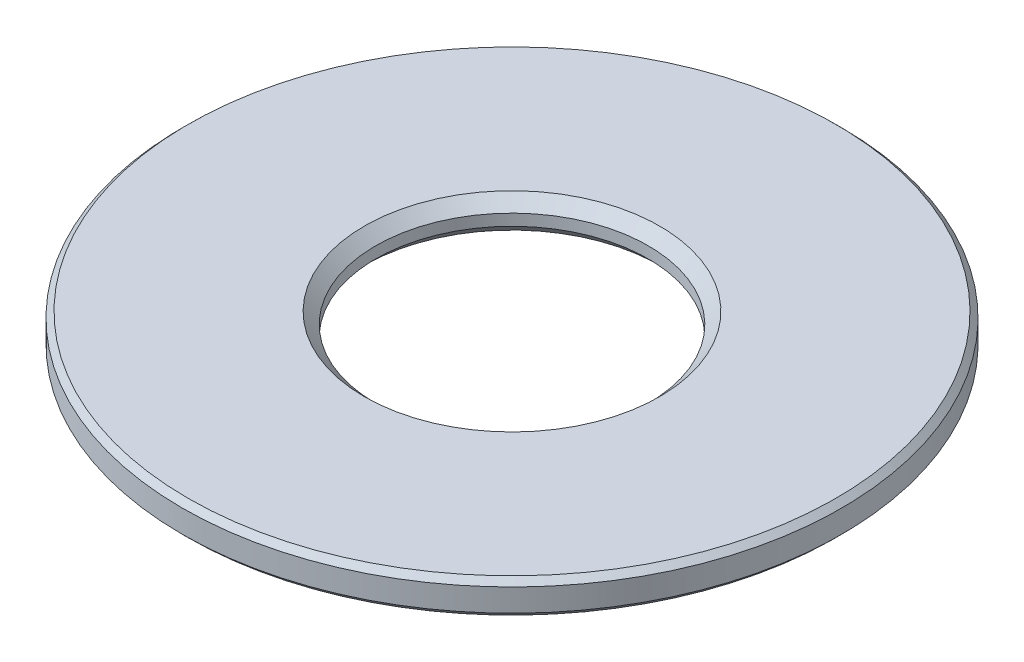
ISO-10303-21;
HEADER;
FILE_DESCRIPTION(('STEP AP214'),'2;1');
FILE_NAME('part.step','',(''),(''),'','','');
FILE_SCHEMA(('AUTOMOTIVE_DESIGN { 1 0 10303 214 1 1 1 1 }'));
ENDSEC;
DATA;
#1=APPLICATION_CONTEXT('core data for automotive mechanical design processes');
#2=APPLICATION_PROTOCOL_DEFINITION('international standard','automotive_design',2000,#1);
#3=PRODUCT_CONTEXT('',#1,'mechanical');
#4=PRODUCT('Part','Part','',(#3));
#5=PRODUCT_RELATED_PRODUCT_CATEGORY('part','',(#4));
#6=PRODUCT_DEFINITION_FORMATION('','',#4);
#7=PRODUCT_DEFINITION_CONTEXT('part definition',#1,'design');
#8=PRODUCT_DEFINITION('design','',#6,#7);
#9=PRODUCT_DEFINITION_SHAPE('','',#8);
#10=(LENGTH_UNIT() NAMED_UNIT(*) SI_UNIT(.MILLI.,.METRE.));
#11=(NAMED_UNIT(*) PLANE_ANGLE_UNIT() SI_UNIT($,.RADIAN.));
#12=(NAMED_UNIT(*) SI_UNIT($,.STERADIAN.) SOLID_ANGLE_UNIT());
#13=UNCERTAINTY_MEASURE_WITH_UNIT(LENGTH_MEASURE(1.E-05),#10,'distance_accuracy_value','');
#14=(GEOMETRIC_REPRESENTATION_CONTEXT(3) GLOBAL_UNCERTAINTY_ASSIGNED_CONTEXT((#13)) GLOBAL_UNIT_ASSIGNED_CONTEXT((#10,
#11,#12)) REPRESENTATION_CONTEXT('',''));
#15=CARTESIAN_POINT('',(0.,0.,0.));
#16=DIRECTION('',(0.,0.,1.));
#17=DIRECTION('',(1.,0.,0.));
#18=AXIS2_PLACEMENT_3D('',#15,#16,#17);
#19=CARTESIAN_POINT('',(0.,3.,0.));
#20=DIRECTION('',(0.,-1.,0.));
#21=DIRECTION('',(0.,0.,-1.));
#22=AXIS2_PLACEMENT_3D('',#19,#20,#21);
#23=CYLINDRICAL_SURFACE('',#22,29.);
#24=CARTESIAN_POINT('',(0.,0.5,0.));
#25=DIRECTION('',(0.,1.,0.));
#26=DIRECTION('',(0.,0.,1.));
#27=AXIS2_PLACEMENT_3D('',#24,#25,#26);
#28=CIRCLE('',#27,29.);
#29=CARTESIAN_POINT('',(0.,0.5,29.));
#30=VERTEX_POINT('',#29);
#31=EDGE_CURVE('E55',#30,#30,#28,.T.);
#32=ORIENTED_EDGE('',*,*,#31,.T.);
#33=EDGE_LOOP('',(#32));
#34=FACE_BOUND('',#33,.T.);
#35=CARTESIAN_POINT('',(0.,2.5,0.));
#36=DIRECTION('',(0.,1.,0.));
#37=DIRECTION('',(0.,0.,1.));
#38=AXIS2_PLACEMENT_3D('',#35,#36,#37);
#39=CIRCLE('',#38,29.);
#40=CARTESIAN_POINT('',(0.,2.5,29.));
#41=VERTEX_POINT('',#40);
#42=EDGE_CURVE('E58',#41,#41,#39,.F.);
#43=ORIENTED_EDGE('',*,*,#42,.T.);
#44=EDGE_LOOP('',(#43));
#45=FACE_BOUND('',#44,.T.);
#46=ADVANCED_FACE('F30',(#34,#45),#23,.T.);
#47=CARTESIAN_POINT('',(0.,3.,0.));
#48=DIRECTION('',(0.,1.,0.));
#49=DIRECTION('',(0.,0.,1.));
#50=AXIS2_PLACEMENT_3D('',#47,#48,#49);
#51=PLANE('',#50);
#52=CARTESIAN_POINT('',(0.,3.,0.));
#53=DIRECTION('',(0.,1.,0.));
#54=DIRECTION('',(0.,0.,1.));
#55=AXIS2_PLACEMENT_3D('',#52,#53,#54);
#56=CIRCLE('',#55,13.);
#57=CARTESIAN_POINT('',(0.,3.,13.));
#58=VERTEX_POINT('',#57);
#59=EDGE_CURVE('E10',#58,#58,#56,.F.);
#60=ORIENTED_EDGE('',*,*,#59,.T.);
#61=EDGE_LOOP('',(#60));
#62=FACE_BOUND('',#61,.T.);
#63=CARTESIAN_POINT('',(0.,3.,0.));
#64=DIRECTION('',(0.,1.,0.));
#65=DIRECTION('',(0.,0.,1.));
#66=AXIS2_PLACEMENT_3D('',#63,#64,#65);
#67=CIRCLE('',#66,28.5);
#68=CARTESIAN_POINT('',(0.,3.,28.5));
#69=VERTEX_POINT('',#68);
#70=EDGE_CURVE('E49',#69,#69,#67,.T.);
#71=ORIENTED_EDGE('',*,*,#70,.T.);
#72=EDGE_LOOP('',(#71));
#73=FACE_BOUND('',#72,.T.);
#74=ADVANCED_FACE('F71',(#62,#73),#51,.T.);
#75=CARTESIAN_POINT('',(0.,0.,0.));
#76=DIRECTION('',(0.,1.,0.));
#77=DIRECTION('',(0.,0.,1.));
#78=AXIS2_PLACEMENT_3D('',#75,#76,#77);
#79=PLANE('',#78);
#80=CARTESIAN_POINT('',(0.,0.,0.));
#81=DIRECTION('',(0.,1.,0.));
#82=DIRECTION('',(0.,0.,1.));
#83=AXIS2_PLACEMENT_3D('',#80,#81,#82);
#84=CIRCLE('',#83,13.);
#85=CARTESIAN_POINT('',(0.,0.,13.));
#86=VERTEX_POINT('',#85);
#87=EDGE_CURVE('E44',#86,#86,#84,.T.);
#88=ORIENTED_EDGE('',*,*,#87,.T.);
#89=EDGE_LOOP('',(#88));
#90=FACE_BOUND('',#89,.T.);
#91=CARTESIAN_POINT('',(0.,0.,0.));
#92=DIRECTION('',(0.,1.,0.));
#93=DIRECTION('',(0.,0.,1.));
#94=AXIS2_PLACEMENT_3D('',#91,#92,#93);
#95=CIRCLE('',#94,28.5);
#96=CARTESIAN_POINT('',(0.,0.,28.5));
#97=VERTEX_POINT('',#96);
#98=EDGE_CURVE('E52',#97,#97,#95,.F.);
#99=ORIENTED_EDGE('',*,*,#98,.T.);
#100=EDGE_LOOP('',(#99));
#101=FACE_BOUND('',#100,.T.);
#102=ADVANCED_FACE('F73',(#90,#101),#79,.F.);
#103=CARTESIAN_POINT('',(0.,0.,0.));
#104=DIRECTION('',(0.,1.,0.));
#105=DIRECTION('',(0.,0.,1.));
#106=AXIS2_PLACEMENT_3D('',#103,#104,#105);
#107=CYLINDRICAL_SURFACE('',#106,12.);
#108=CARTESIAN_POINT('',(0.,1.,0.));
#109=DIRECTION('',(0.,1.,0.));
#110=DIRECTION('',(0.,0.,1.));
#111=AXIS2_PLACEMENT_3D('',#108,#109,#110);
#112=CIRCLE('',#111,12.);
#113=CARTESIAN_POINT('',(0.,1.,12.));
#114=VERTEX_POINT('',#113);
#115=EDGE_CURVE('E36',#114,#114,#112,.F.);
#116=ORIENTED_EDGE('',*,*,#115,.T.);
#117=EDGE_LOOP('',(#116));
#118=FACE_BOUND('',#117,.T.);
#119=CARTESIAN_POINT('',(0.,2.,0.));
#120=DIRECTION('',(0.,1.,0.));
#121=DIRECTION('',(0.,0.,1.));
#122=AXIS2_PLACEMENT_3D('',#119,#120,#121);
#123=CIRCLE('',#122,12.);
#124=CARTESIAN_POINT('',(0.,2.,12.));
#125=VERTEX_POINT('',#124);
#126=EDGE_CURVE('E40',#125,#125,#123,.T.);
#127=ORIENTED_EDGE('',*,*,#126,.T.);
#128=EDGE_LOOP('',(#127));
#129=FACE_BOUND('',#128,.T.);
#130=ADVANCED_FACE('F78',(#118,#129),#107,.F.);
#131=CARTESIAN_POINT('',(0.,0.5,0.));
#132=DIRECTION('',(0.,1.,0.));
#133=DIRECTION('',(0.,0.,1.));
#134=AXIS2_PLACEMENT_3D('',#131,#132,#133);
#135=CONICAL_SURFACE('',#134,29.,0.785398163397452);
#136=ORIENTED_EDGE('',*,*,#98,.F.);
#137=EDGE_LOOP('',(#136));
#138=FACE_BOUND('',#137,.T.);
#139=ORIENTED_EDGE('',*,*,#31,.F.);
#140=EDGE_LOOP('',(#139));
#141=FACE_BOUND('',#140,.T.);
#142=ADVANCED_FACE('F67',(#138,#141),#135,.T.);
#143=CARTESIAN_POINT('',(0.,3.,0.));
#144=DIRECTION('',(0.,-1.,0.));
#145=DIRECTION('',(0.,0.,-1.));
#146=AXIS2_PLACEMENT_3D('',#143,#144,#145);
#147=CONICAL_SURFACE('',#146,28.5,0.785398163397441);
#148=ORIENTED_EDGE('',*,*,#42,.F.);
#149=EDGE_LOOP('',(#148));
#150=FACE_BOUND('',#149,.T.);
#151=ORIENTED_EDGE('',*,*,#70,.F.);
#152=EDGE_LOOP('',(#151));
#153=FACE_BOUND('',#152,.T.);
#154=ADVANCED_FACE('F63',(#150,#153),#147,.T.);
#155=CARTESIAN_POINT('',(0.,0.,0.));
#156=DIRECTION('',(0.,-1.,0.));
#157=DIRECTION('',(0.,0.,-1.));
#158=AXIS2_PLACEMENT_3D('',#155,#156,#157);
#159=CONICAL_SURFACE('',#158,13.,0.785398163397447);
#160=ORIENTED_EDGE('',*,*,#115,.F.);
#161=EDGE_LOOP('',(#160));
#162=FACE_BOUND('',#161,.T.);
#163=ORIENTED_EDGE('',*,*,#87,.F.);
#164=EDGE_LOOP('',(#163));
#165=FACE_BOUND('',#164,.T.);
#166=ADVANCED_FACE('F66',(#162,#165),#159,.F.);
#167=CARTESIAN_POINT('',(0.,2.,0.));
#168=DIRECTION('',(0.,1.,0.));
#169=DIRECTION('',(0.,0.,1.));
#170=AXIS2_PLACEMENT_3D('',#167,#168,#169);
#171=CONICAL_SURFACE('',#170,12.,0.78539816339745);
#172=ORIENTED_EDGE('',*,*,#59,.F.);
#173=EDGE_LOOP('',(#172));
#174=FACE_BOUND('',#173,.T.);
#175=ORIENTED_EDGE('',*,*,#126,.F.);
#176=EDGE_LOOP('',(#175));
#177=FACE_BOUND('',#176,.T.);
#178=ADVANCED_FACE('F90',(#174,#177),#171,.F.);
#179=CLOSED_SHELL('',(#46,#74,#102,#130,#142,#154,#166,#178));
#180=MANIFOLD_SOLID_BREP('B2',#179);
#181=ADVANCED_BREP_SHAPE_REPRESENTATION('',(#18,#180),#14);
#182=SHAPE_DEFINITION_REPRESENTATION(#9,#181);
ENDSEC;
END-ISO-10303-21;
